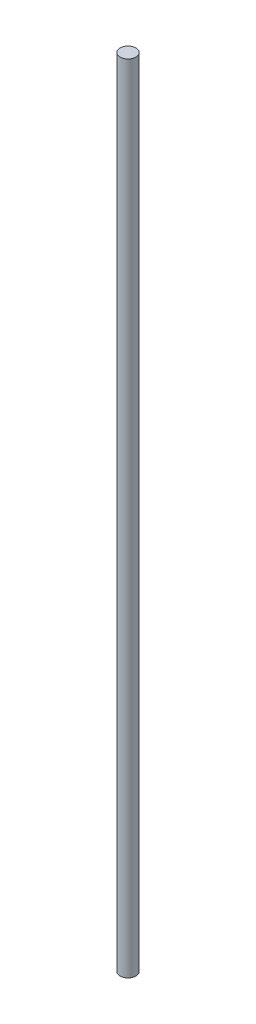
ISO-10303-21;
HEADER;
FILE_DESCRIPTION(('STEP AP214'),'2;1');
FILE_NAME('part.step','',(''),(''),'','','');
FILE_SCHEMA(('AUTOMOTIVE_DESIGN { 1 0 10303 214 1 1 1 1 }'));
ENDSEC;
DATA;
#1=APPLICATION_CONTEXT('core data for automotive mechanical design processes');
#2=APPLICATION_PROTOCOL_DEFINITION('international standard','automotive_design',2000,#1);
#3=PRODUCT_CONTEXT('',#1,'mechanical');
#4=PRODUCT('Part','Part','',(#3));
#5=PRODUCT_RELATED_PRODUCT_CATEGORY('part','',(#4));
#6=PRODUCT_DEFINITION_FORMATION('','',#4);
#7=PRODUCT_DEFINITION_CONTEXT('part definition',#1,'design');
#8=PRODUCT_DEFINITION('design','',#6,#7);
#9=PRODUCT_DEFINITION_SHAPE('','',#8);
#10=(LENGTH_UNIT() NAMED_UNIT(*) SI_UNIT(.MILLI.,.METRE.));
#11=(NAMED_UNIT(*) PLANE_ANGLE_UNIT() SI_UNIT($,.RADIAN.));
#12=(NAMED_UNIT(*) SI_UNIT($,.STERADIAN.) SOLID_ANGLE_UNIT());
#13=UNCERTAINTY_MEASURE_WITH_UNIT(LENGTH_MEASURE(1.E-05),#10,'distance_accuracy_value','');
#14=(GEOMETRIC_REPRESENTATION_CONTEXT(3) GLOBAL_UNCERTAINTY_ASSIGNED_CONTEXT((#13)) GLOBAL_UNIT_ASSIGNED_CONTEXT((#10,
#11,#12)) REPRESENTATION_CONTEXT('',''));
#15=CARTESIAN_POINT('',(0.,0.,0.));
#16=DIRECTION('',(0.,0.,1.));
#17=DIRECTION('',(1.,0.,0.));
#18=AXIS2_PLACEMENT_3D('',#15,#16,#17);
#19=CARTESIAN_POINT('',(0.,400.,0.));
#20=DIRECTION('',(0.,-1.,0.));
#21=DIRECTION('',(0.,0.,-1.));
#22=AXIS2_PLACEMENT_3D('',#19,#20,#21);
#23=CYLINDRICAL_SURFACE('',#22,4.);
#24=CARTESIAN_POINT('',(0.,400.,0.));
#25=DIRECTION('',(0.,1.,0.));
#26=DIRECTION('',(0.,0.,1.));
#27=AXIS2_PLACEMENT_3D('',#24,#25,#26);
#28=CIRCLE('',#27,4.);
#29=CARTESIAN_POINT('',(0.,400.,4.));
#30=VERTEX_POINT('',#29);
#31=EDGE_CURVE('E10',#30,#30,#28,.T.);
#32=ORIENTED_EDGE('',*,*,#31,.F.);
#33=EDGE_LOOP('',(#32));
#34=FACE_BOUND('',#33,.T.);
#35=CARTESIAN_POINT('',(0.,0.,0.));
#36=DIRECTION('',(0.,1.,0.));
#37=DIRECTION('',(0.,0.,1.));
#38=AXIS2_PLACEMENT_3D('',#35,#36,#37);
#39=CIRCLE('',#38,4.);
#40=CARTESIAN_POINT('',(0.,0.,4.));
#41=VERTEX_POINT('',#40);
#42=EDGE_CURVE('E34',#41,#41,#39,.T.);
#43=ORIENTED_EDGE('',*,*,#42,.T.);
#44=EDGE_LOOP('',(#43));
#45=FACE_BOUND('',#44,.T.);
#46=ADVANCED_FACE('F31',(#34,#45),#23,.T.);
#47=CARTESIAN_POINT('',(0.,400.,0.));
#48=DIRECTION('',(0.,1.,0.));
#49=DIRECTION('',(0.,0.,1.));
#50=AXIS2_PLACEMENT_3D('',#47,#48,#49);
#51=PLANE('',#50);
#52=ORIENTED_EDGE('',*,*,#31,.T.);
#53=EDGE_LOOP('',(#52));
#54=FACE_BOUND('',#53,.T.);
#55=ADVANCED_FACE('F46',(#54),#51,.T.);
#56=CARTESIAN_POINT('',(0.,0.,0.));
#57=DIRECTION('',(0.,1.,0.));
#58=DIRECTION('',(0.,0.,1.));
#59=AXIS2_PLACEMENT_3D('',#56,#57,#58);
#60=PLANE('',#59);
#61=ORIENTED_EDGE('',*,*,#42,.F.);
#62=EDGE_LOOP('',(#61));
#63=FACE_BOUND('',#62,.T.);
#64=ADVANCED_FACE('F44',(#63),#60,.F.);
#65=CLOSED_SHELL('',(#46,#55,#64));
#66=MANIFOLD_SOLID_BREP('B2',#65);
#67=ADVANCED_BREP_SHAPE_REPRESENTATION('',(#18,#66),#14);
#68=SHAPE_DEFINITION_REPRESENTATION(#9,#67);
ENDSEC;
END-ISO-10303-21;
